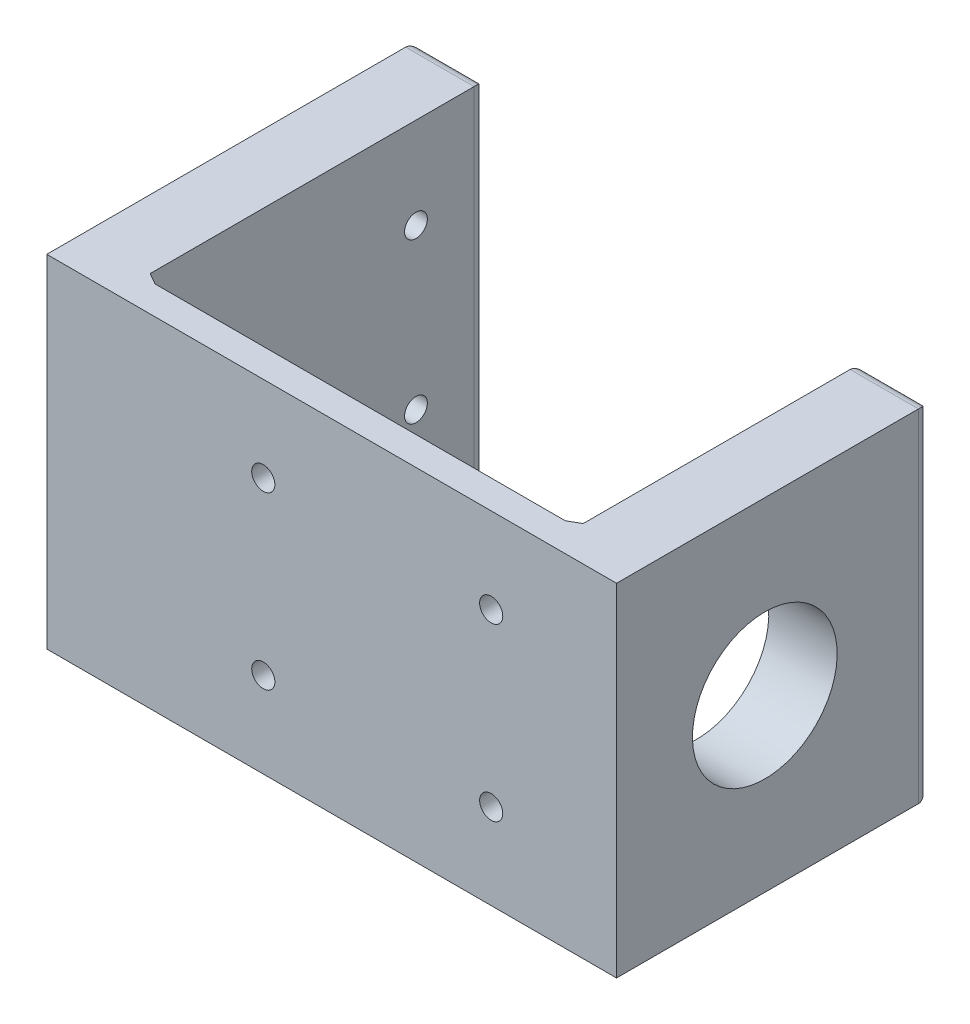
ISO-10303-21;
HEADER;
FILE_DESCRIPTION(('STEP AP214'),'2;1');
FILE_NAME('part.step','',(''),(''),'','','');
FILE_SCHEMA(('AUTOMOTIVE_DESIGN { 1 0 10303 214 1 1 1 1 }'));
ENDSEC;
DATA;
#1=APPLICATION_CONTEXT('core data for automotive mechanical design processes');
#2=APPLICATION_PROTOCOL_DEFINITION('international standard','automotive_design',2000,#1);
#3=PRODUCT_CONTEXT('',#1,'mechanical');
#4=PRODUCT('Part','Part','',(#3));
#5=PRODUCT_RELATED_PRODUCT_CATEGORY('part','',(#4));
#6=PRODUCT_DEFINITION_FORMATION('','',#4);
#7=PRODUCT_DEFINITION_CONTEXT('part definition',#1,'design');
#8=PRODUCT_DEFINITION('design','',#6,#7);
#9=PRODUCT_DEFINITION_SHAPE('','',#8);
#10=(LENGTH_UNIT() NAMED_UNIT(*) SI_UNIT(.MILLI.,.METRE.));
#11=(NAMED_UNIT(*) PLANE_ANGLE_UNIT() SI_UNIT($,.RADIAN.));
#12=(NAMED_UNIT(*) SI_UNIT($,.STERADIAN.) SOLID_ANGLE_UNIT());
#13=UNCERTAINTY_MEASURE_WITH_UNIT(LENGTH_MEASURE(1.E-05),#10,'distance_accuracy_value','');
#14=(GEOMETRIC_REPRESENTATION_CONTEXT(3) GLOBAL_UNCERTAINTY_ASSIGNED_CONTEXT((#13)) GLOBAL_UNIT_ASSIGNED_CONTEXT((#10,
#11,#12)) REPRESENTATION_CONTEXT('',''));
#15=CARTESIAN_POINT('',(0.,0.,0.));
#16=DIRECTION('',(0.,0.,1.));
#17=DIRECTION('',(1.,0.,0.));
#18=AXIS2_PLACEMENT_3D('',#15,#16,#17);
#19=CARTESIAN_POINT('',(0.,0.,0.));
#20=DIRECTION('',(0.,0.,-1.));
#21=DIRECTION('',(-1.,0.,0.));
#22=AXIS2_PLACEMENT_3D('',#19,#20,#21);
#23=PLANE('',#22);
#24=CARTESIAN_POINT('',(-78.74,57.15,0.));
#25=DIRECTION('',(0.,0.,1.));
#26=DIRECTION('',(1.,0.,0.));
#27=AXIS2_PLACEMENT_3D('',#24,#25,#26);
#28=CIRCLE('',#27,2.57975099999999);
#29=CARTESIAN_POINT('',(-76.160249,57.15,0.));
#30=VERTEX_POINT('',#29);
#31=EDGE_CURVE('E322',#30,#30,#28,.T.);
#32=ORIENTED_EDGE('',*,*,#31,.T.);
#33=EDGE_LOOP('',(#32));
#34=FACE_BOUND('',#33,.T.);
#35=CARTESIAN_POINT('',(-78.74,19.05,0.));
#36=DIRECTION('',(0.,0.,1.));
#37=DIRECTION('',(1.,0.,0.));
#38=AXIS2_PLACEMENT_3D('',#35,#36,#37);
#39=CIRCLE('',#38,2.57975099999999);
#40=CARTESIAN_POINT('',(-76.160249,19.05,0.));
#41=VERTEX_POINT('',#40);
#42=EDGE_CURVE('E330',#41,#41,#39,.T.);
#43=ORIENTED_EDGE('',*,*,#42,.T.);
#44=EDGE_LOOP('',(#43));
#45=FACE_BOUND('',#44,.T.);
#46=CARTESIAN_POINT('',(-27.94,57.15,0.));
#47=DIRECTION('',(0.,0.,1.));
#48=DIRECTION('',(1.,0.,0.));
#49=AXIS2_PLACEMENT_3D('',#46,#47,#48);
#50=CIRCLE('',#49,2.57975099999999);
#51=CARTESIAN_POINT('',(-25.360249,57.15,0.));
#52=VERTEX_POINT('',#51);
#53=EDGE_CURVE('E338',#52,#52,#50,.T.);
#54=ORIENTED_EDGE('',*,*,#53,.T.);
#55=EDGE_LOOP('',(#54));
#56=FACE_BOUND('',#55,.T.);
#57=CARTESIAN_POINT('',(-27.94,19.05,0.));
#58=DIRECTION('',(0.,0.,1.));
#59=DIRECTION('',(1.,0.,0.));
#60=AXIS2_PLACEMENT_3D('',#57,#58,#59);
#61=CIRCLE('',#60,2.57975099999999);
#62=CARTESIAN_POINT('',(-25.360249,19.05,0.));
#63=VERTEX_POINT('',#62);
#64=EDGE_CURVE('E186',#63,#63,#61,.T.);
#65=ORIENTED_EDGE('',*,*,#64,.T.);
#66=EDGE_LOOP('',(#65));
#67=FACE_BOUND('',#66,.T.);
#68=DIRECTION('',(1.,0.,0.));
#69=VECTOR('',#68,1.);
#70=CARTESIAN_POINT('',(-127.,0.,0.));
#71=LINE('',#70,#69);
#72=CARTESIAN_POINT('',(-109.22,0.,0.));
#73=VERTEX_POINT('',#72);
#74=CARTESIAN_POINT('',(-17.78,0.,0.));
#75=VERTEX_POINT('',#74);
#76=EDGE_CURVE('E183',#73,#75,#71,.T.);
#77=ORIENTED_EDGE('',*,*,#76,.F.);
#78=DIRECTION('',(0.,1.,0.));
#79=VECTOR('',#78,1.);
#80=CARTESIAN_POINT('',(-109.22,0.,0.));
#81=LINE('',#80,#79);
#82=CARTESIAN_POINT('',(-109.22,76.2,0.));
#83=VERTEX_POINT('',#82);
#84=EDGE_CURVE('E255',#73,#83,#81,.T.);
#85=ORIENTED_EDGE('',*,*,#84,.T.);
#86=DIRECTION('',(1.,0.,0.));
#87=VECTOR('',#86,1.);
#88=CARTESIAN_POINT('',(-127.,76.2,0.));
#89=LINE('',#88,#87);
#90=CARTESIAN_POINT('',(-17.78,76.2,0.));
#91=VERTEX_POINT('',#90);
#92=EDGE_CURVE('E157',#83,#91,#89,.T.);
#93=ORIENTED_EDGE('',*,*,#92,.T.);
#94=DIRECTION('',(0.,-1.,0.));
#95=VECTOR('',#94,1.);
#96=CARTESIAN_POINT('',(-17.78,0.,0.));
#97=LINE('',#96,#95);
#98=EDGE_CURVE('E199',#91,#75,#97,.T.);
#99=ORIENTED_EDGE('',*,*,#98,.T.);
#100=EDGE_LOOP('',(#77,#85,#93,#99));
#101=FACE_BOUND('',#100,.T.);
#102=ADVANCED_FACE('F41',(#34,#45,#56,#67,#101),#23,.T.);
#103=CARTESIAN_POINT('',(-127.,0.,6.35));
#104=DIRECTION('',(0.,1.,0.));
#105=DIRECTION('',(0.,0.,1.));
#106=AXIS2_PLACEMENT_3D('',#103,#104,#105);
#107=PLANE('',#106);
#108=DIRECTION('',(0.,0.,-1.));
#109=VECTOR('',#108,1.);
#110=CARTESIAN_POINT('',(-127.,0.,6.35));
#111=LINE('',#110,#109);
#112=CARTESIAN_POINT('',(-127.,0.,6.35));
#113=VERTEX_POINT('',#112);
#114=CARTESIAN_POINT('',(-127.,0.,-73.66));
#115=VERTEX_POINT('',#114);
#116=EDGE_CURVE('E182',#113,#115,#111,.T.);
#117=ORIENTED_EDGE('',*,*,#116,.T.);
#118=DIRECTION('',(-1.,0.,0.));
#119=VECTOR('',#118,1.);
#120=CARTESIAN_POINT('',(-111.76,0.,-73.66));
#121=LINE('',#120,#119);
#122=CARTESIAN_POINT('',(-111.76,0.,-73.66));
#123=VERTEX_POINT('',#122);
#124=EDGE_CURVE('E278',#115,#123,#121,.F.);
#125=ORIENTED_EDGE('',*,*,#124,.T.);
#126=DIRECTION('',(0.,0.,1.));
#127=VECTOR('',#126,1.);
#128=CARTESIAN_POINT('',(-111.76,0.,-76.2));
#129=LINE('',#128,#127);
#130=CARTESIAN_POINT('',(-111.76,0.,-1.46646968374167));
#131=VERTEX_POINT('',#130);
#132=EDGE_CURVE('E301',#123,#131,#129,.T.);
#133=ORIENTED_EDGE('',*,*,#132,.T.);
#134=DIRECTION('',(0.866025403784438,0.,0.500000000000001));
#135=VECTOR('',#134,1.);
#136=CARTESIAN_POINT('',(-119.805369342985,0.,-6.11146583964366));
#137=LINE('',#136,#135);
#138=EDGE_CURVE('E258',#131,#73,#137,.T.);
#139=ORIENTED_EDGE('',*,*,#138,.T.);
#140=ORIENTED_EDGE('',*,*,#76,.T.);
#141=DIRECTION('',(0.866025403784436,0.,-0.500000000000005));
#142=VECTOR('',#141,1.);
#143=CARTESIAN_POINT('',(-102.444630657015,0.,48.8811473006686));
#144=LINE('',#143,#142);
#145=CARTESIAN_POINT('',(-15.24,0.,-1.46646968374164));
#146=VERTEX_POINT('',#145);
#147=EDGE_CURVE('E207',#75,#146,#144,.T.);
#148=ORIENTED_EDGE('',*,*,#147,.T.);
#149=DIRECTION('',(0.,0.,1.));
#150=VECTOR('',#149,1.);
#151=CARTESIAN_POINT('',(-15.24,0.,-63.5));
#152=LINE('',#151,#150);
#153=CARTESIAN_POINT('',(-15.24,0.,-60.96));
#154=VERTEX_POINT('',#153);
#155=EDGE_CURVE('E251',#154,#146,#152,.T.);
#156=ORIENTED_EDGE('',*,*,#155,.F.);
#157=DIRECTION('',(-1.,0.,0.));
#158=VECTOR('',#157,1.);
#159=CARTESIAN_POINT('',(0.,0.,-60.96));
#160=LINE('',#159,#158);
#161=CARTESIAN_POINT('',(0.,0.,-60.96));
#162=VERTEX_POINT('',#161);
#163=EDGE_CURVE('E165',#154,#162,#160,.F.);
#164=ORIENTED_EDGE('',*,*,#163,.T.);
#165=DIRECTION('',(0.,0.,-1.));
#166=VECTOR('',#165,1.);
#167=CARTESIAN_POINT('',(0.,0.,6.35));
#168=LINE('',#167,#166);
#169=CARTESIAN_POINT('',(0.,0.,6.35));
#170=VERTEX_POINT('',#169);
#171=EDGE_CURVE('E161',#170,#162,#168,.T.);
#172=ORIENTED_EDGE('',*,*,#171,.F.);
#173=DIRECTION('',(1.,0.,0.));
#174=VECTOR('',#173,1.);
#175=CARTESIAN_POINT('',(-127.,0.,6.35));
#176=LINE('',#175,#174);
#177=EDGE_CURVE('E144',#113,#170,#176,.T.);
#178=ORIENTED_EDGE('',*,*,#177,.F.);
#179=EDGE_LOOP('',(#117,#125,#133,#139,#140,#148,#156,#164,#172,#178));
#180=FACE_BOUND('',#179,.T.);
#181=ADVANCED_FACE('F162',(#180),#107,.F.);
#182=CARTESIAN_POINT('',(0.,76.2,6.35));
#183=DIRECTION('',(1.,0.,0.));
#184=DIRECTION('',(0.,1.,0.));
#185=AXIS2_PLACEMENT_3D('',#182,#183,#184);
#186=PLANE('',#185);
#187=CARTESIAN_POINT('',(0.,38.019999999998,-26.700000000002));
#188=DIRECTION('',(1.,0.,0.));
#189=DIRECTION('',(0.,1.,0.));
#190=AXIS2_PLACEMENT_3D('',#187,#188,#189);
#191=CIRCLE('',#190,16.129);
#192=CARTESIAN_POINT('',(0.,54.148999999998,-26.700000000002));
#193=VERTEX_POINT('',#192);
#194=EDGE_CURVE('E667',#193,#193,#191,.T.);
#195=ORIENTED_EDGE('',*,*,#194,.F.);
#196=EDGE_LOOP('',(#195));
#197=FACE_BOUND('',#196,.T.);
#198=ORIENTED_EDGE('',*,*,#171,.T.);
#199=DIRECTION('',(0.,-1.,0.));
#200=VECTOR('',#199,1.);
#201=CARTESIAN_POINT('',(0.,76.2,-60.96));
#202=LINE('',#201,#200);
#203=CARTESIAN_POINT('',(0.,76.2,-60.96));
#204=VERTEX_POINT('',#203);
#205=EDGE_CURVE('E232',#162,#204,#202,.F.);
#206=ORIENTED_EDGE('',*,*,#205,.T.);
#207=DIRECTION('',(0.,0.,-1.));
#208=VECTOR('',#207,1.);
#209=CARTESIAN_POINT('',(0.,76.2,6.35));
#210=LINE('',#209,#208);
#211=CARTESIAN_POINT('',(0.,76.2,6.35));
#212=VERTEX_POINT('',#211);
#213=EDGE_CURVE('E169',#212,#204,#210,.T.);
#214=ORIENTED_EDGE('',*,*,#213,.F.);
#215=DIRECTION('',(0.,-1.,0.));
#216=VECTOR('',#215,1.);
#217=CARTESIAN_POINT('',(0.,76.2,6.35));
#218=LINE('',#217,#216);
#219=EDGE_CURVE('E149',#212,#170,#218,.T.);
#220=ORIENTED_EDGE('',*,*,#219,.T.);
#221=EDGE_LOOP('',(#198,#206,#214,#220));
#222=FACE_BOUND('',#221,.T.);
#223=ADVANCED_FACE('F171',(#197,#222),#186,.T.);
#224=CARTESIAN_POINT('',(-127.,76.2,6.35));
#225=DIRECTION('',(0.,1.,0.));
#226=DIRECTION('',(-1.,0.,0.));
#227=AXIS2_PLACEMENT_3D('',#224,#225,#226);
#228=PLANE('',#227);
#229=DIRECTION('',(0.,0.,1.));
#230=VECTOR('',#229,1.);
#231=CARTESIAN_POINT('',(-111.76,76.2,-76.2));
#232=LINE('',#231,#230);
#233=CARTESIAN_POINT('',(-111.76,76.2,-73.66));
#234=VERTEX_POINT('',#233);
#235=CARTESIAN_POINT('',(-111.76,76.2,-1.46646968374167));
#236=VERTEX_POINT('',#235);
#237=EDGE_CURVE('E240',#234,#236,#232,.T.);
#238=ORIENTED_EDGE('',*,*,#237,.F.);
#239=DIRECTION('',(1.,0.,0.));
#240=VECTOR('',#239,1.);
#241=CARTESIAN_POINT('',(-127.,76.2,-73.66));
#242=LINE('',#241,#240);
#243=CARTESIAN_POINT('',(-127.,76.2,-73.66));
#244=VERTEX_POINT('',#243);
#245=EDGE_CURVE('E11',#234,#244,#242,.F.);
#246=ORIENTED_EDGE('',*,*,#245,.T.);
#247=DIRECTION('',(0.,0.,-1.));
#248=VECTOR('',#247,1.);
#249=CARTESIAN_POINT('',(-127.,76.2,6.35));
#250=LINE('',#249,#248);
#251=CARTESIAN_POINT('',(-127.,76.2,6.35));
#252=VERTEX_POINT('',#251);
#253=EDGE_CURVE('E191',#252,#244,#250,.T.);
#254=ORIENTED_EDGE('',*,*,#253,.F.);
#255=DIRECTION('',(1.,0.,0.));
#256=VECTOR('',#255,1.);
#257=CARTESIAN_POINT('',(-127.,76.2,6.35));
#258=LINE('',#257,#256);
#259=EDGE_CURVE('E174',#252,#212,#258,.T.);
#260=ORIENTED_EDGE('',*,*,#259,.T.);
#261=ORIENTED_EDGE('',*,*,#213,.T.);
#262=DIRECTION('',(1.,0.,0.));
#263=VECTOR('',#262,1.);
#264=CARTESIAN_POINT('',(-127.,76.2,-60.96));
#265=LINE('',#264,#263);
#266=CARTESIAN_POINT('',(-15.24,76.2,-60.96));
#267=VERTEX_POINT('',#266);
#268=EDGE_CURVE('E229',#204,#267,#265,.F.);
#269=ORIENTED_EDGE('',*,*,#268,.T.);
#270=DIRECTION('',(0.,0.,1.));
#271=VECTOR('',#270,1.);
#272=CARTESIAN_POINT('',(-15.24,76.2,-63.5));
#273=LINE('',#272,#271);
#274=CARTESIAN_POINT('',(-15.24,76.2,-1.46646968374164));
#275=VERTEX_POINT('',#274);
#276=EDGE_CURVE('E315',#267,#275,#273,.T.);
#277=ORIENTED_EDGE('',*,*,#276,.T.);
#278=DIRECTION('',(-0.866025403784436,0.,0.500000000000005));
#279=VECTOR('',#278,1.);
#280=CARTESIAN_POINT('',(-15.24,76.2,-1.46646968374164));
#281=LINE('',#280,#279);
#282=EDGE_CURVE('E203',#275,#91,#281,.T.);
#283=ORIENTED_EDGE('',*,*,#282,.T.);
#284=ORIENTED_EDGE('',*,*,#92,.F.);
#285=DIRECTION('',(-0.866025403784438,0.,-0.500000000000001));
#286=VECTOR('',#285,1.);
#287=CARTESIAN_POINT('',(-111.76,76.2,-1.46646968374164));
#288=LINE('',#287,#286);
#289=EDGE_CURVE('E261',#83,#236,#288,.T.);
#290=ORIENTED_EDGE('',*,*,#289,.T.);
#291=EDGE_LOOP('',(#238,#246,#254,#260,#261,#269,#277,#283,#284,#290));
#292=FACE_BOUND('',#291,.T.);
#293=ADVANCED_FACE('F365',(#292),#228,.T.);
#294=CARTESIAN_POINT('',(-127.,76.2,6.35));
#295=DIRECTION('',(1.,0.,0.));
#296=DIRECTION('',(0.,1.,0.));
#297=AXIS2_PLACEMENT_3D('',#294,#295,#296);
#298=PLANE('',#297);
#299=CARTESIAN_POINT('',(-127.,55.88,-12.7));
#300=DIRECTION('',(-1.,0.,0.));
#301=DIRECTION('',(0.,1.,0.));
#302=AXIS2_PLACEMENT_3D('',#299,#300,#301);
#303=CIRCLE('',#302,2.54);
#304=CARTESIAN_POINT('',(-127.,58.42,-12.7));
#305=VERTEX_POINT('',#304);
#306=EDGE_CURVE('E689',#305,#305,#303,.T.);
#307=ORIENTED_EDGE('',*,*,#306,.F.);
#308=EDGE_LOOP('',(#307));
#309=FACE_BOUND('',#308,.T.);
#310=CARTESIAN_POINT('',(-127.,20.32,-60.7000000000003));
#311=DIRECTION('',(-1.,0.,0.));
#312=DIRECTION('',(0.,-1.,0.));
#313=AXIS2_PLACEMENT_3D('',#310,#311,#312);
#314=CIRCLE('',#313,2.54);
#315=CARTESIAN_POINT('',(-127.,17.78,-60.7000000000003));
#316=VERTEX_POINT('',#315);
#317=EDGE_CURVE('E684',#316,#316,#314,.T.);
#318=ORIENTED_EDGE('',*,*,#317,.F.);
#319=EDGE_LOOP('',(#318));
#320=FACE_BOUND('',#319,.T.);
#321=CARTESIAN_POINT('',(-127.,55.88,-60.7000000000003));
#322=DIRECTION('',(-1.,0.,0.));
#323=DIRECTION('',(0.,1.,0.));
#324=AXIS2_PLACEMENT_3D('',#321,#322,#323);
#325=CIRCLE('',#324,2.54);
#326=CARTESIAN_POINT('',(-127.,58.42,-60.7000000000003));
#327=VERTEX_POINT('',#326);
#328=EDGE_CURVE('E672',#327,#327,#325,.T.);
#329=ORIENTED_EDGE('',*,*,#328,.F.);
#330=EDGE_LOOP('',(#329));
#331=FACE_BOUND('',#330,.T.);
#332=CARTESIAN_POINT('',(-127.,20.32,-12.7));
#333=DIRECTION('',(-1.,0.,0.));
#334=DIRECTION('',(0.,-1.,0.));
#335=AXIS2_PLACEMENT_3D('',#332,#333,#334);
#336=CIRCLE('',#335,2.54);
#337=CARTESIAN_POINT('',(-127.,17.78,-12.7));
#338=VERTEX_POINT('',#337);
#339=EDGE_CURVE('E290',#338,#338,#336,.T.);
#340=ORIENTED_EDGE('',*,*,#339,.F.);
#341=EDGE_LOOP('',(#340));
#342=FACE_BOUND('',#341,.T.);
#343=ORIENTED_EDGE('',*,*,#253,.T.);
#344=DIRECTION('',(0.,1.,0.));
#345=VECTOR('',#344,1.);
#346=CARTESIAN_POINT('',(-127.,0.,-73.66));
#347=LINE('',#346,#345);
#348=EDGE_CURVE('E51',#244,#115,#347,.F.);
#349=ORIENTED_EDGE('',*,*,#348,.T.);
#350=ORIENTED_EDGE('',*,*,#116,.F.);
#351=DIRECTION('',(0.,-1.,0.));
#352=VECTOR('',#351,1.);
#353=CARTESIAN_POINT('',(-127.,76.2,6.35));
#354=LINE('',#353,#352);
#355=EDGE_CURVE('E152',#252,#113,#354,.T.);
#356=ORIENTED_EDGE('',*,*,#355,.F.);
#357=EDGE_LOOP('',(#343,#349,#350,#356));
#358=FACE_BOUND('',#357,.T.);
#359=ADVANCED_FACE('F359',(#309,#320,#331,#342,#358),#298,.F.);
#360=CARTESIAN_POINT('',(0.,0.,6.35));
#361=DIRECTION('',(0.,0.,-1.));
#362=DIRECTION('',(-1.,0.,0.));
#363=AXIS2_PLACEMENT_3D('',#360,#361,#362);
#364=PLANE('',#363);
#365=CARTESIAN_POINT('',(-78.74,57.15,6.35));
#366=DIRECTION('',(0.,0.,1.));
#367=DIRECTION('',(1.,0.,0.));
#368=AXIS2_PLACEMENT_3D('',#365,#366,#367);
#369=CIRCLE('',#368,2.57975100000001);
#370=CARTESIAN_POINT('',(-76.160249,57.15,6.35));
#371=VERTEX_POINT('',#370);
#372=EDGE_CURVE('E318',#371,#371,#369,.T.);
#373=ORIENTED_EDGE('',*,*,#372,.F.);
#374=EDGE_LOOP('',(#373));
#375=FACE_BOUND('',#374,.T.);
#376=CARTESIAN_POINT('',(-78.74,19.05,6.35));
#377=DIRECTION('',(0.,0.,1.));
#378=DIRECTION('',(1.,0.,0.));
#379=AXIS2_PLACEMENT_3D('',#376,#377,#378);
#380=CIRCLE('',#379,2.57975100000001);
#381=CARTESIAN_POINT('',(-76.160249,19.05,6.35));
#382=VERTEX_POINT('',#381);
#383=EDGE_CURVE('E326',#382,#382,#380,.T.);
#384=ORIENTED_EDGE('',*,*,#383,.F.);
#385=EDGE_LOOP('',(#384));
#386=FACE_BOUND('',#385,.T.);
#387=CARTESIAN_POINT('',(-27.94,57.15,6.35));
#388=DIRECTION('',(0.,0.,1.));
#389=DIRECTION('',(1.,0.,0.));
#390=AXIS2_PLACEMENT_3D('',#387,#388,#389);
#391=CIRCLE('',#390,2.579751);
#392=CARTESIAN_POINT('',(-25.360249,57.15,6.35));
#393=VERTEX_POINT('',#392);
#394=EDGE_CURVE('E334',#393,#393,#391,.T.);
#395=ORIENTED_EDGE('',*,*,#394,.F.);
#396=EDGE_LOOP('',(#395));
#397=FACE_BOUND('',#396,.T.);
#398=CARTESIAN_POINT('',(-27.94,19.05,6.35));
#399=DIRECTION('',(0.,0.,1.));
#400=DIRECTION('',(1.,0.,0.));
#401=AXIS2_PLACEMENT_3D('',#398,#399,#400);
#402=CIRCLE('',#401,2.579751);
#403=CARTESIAN_POINT('',(-25.360249,19.05,6.35));
#404=VERTEX_POINT('',#403);
#405=EDGE_CURVE('E342',#404,#404,#402,.T.);
#406=ORIENTED_EDGE('',*,*,#405,.F.);
#407=EDGE_LOOP('',(#406));
#408=FACE_BOUND('',#407,.T.);
#409=ORIENTED_EDGE('',*,*,#177,.T.);
#410=ORIENTED_EDGE('',*,*,#219,.F.);
#411=ORIENTED_EDGE('',*,*,#259,.F.);
#412=ORIENTED_EDGE('',*,*,#355,.T.);
#413=EDGE_LOOP('',(#409,#410,#411,#412));
#414=FACE_BOUND('',#413,.T.);
#415=ADVANCED_FACE('F146',(#375,#386,#397,#408,#414),#364,.F.);
#416=CARTESIAN_POINT('',(-27.94,19.05,6.35));
#417=DIRECTION('',(0.,0.,1.));
#418=DIRECTION('',(1.,0.,0.));
#419=AXIS2_PLACEMENT_3D('',#416,#417,#418);
#420=CYLINDRICAL_SURFACE('',#419,2.57975099999999);
#421=ORIENTED_EDGE('',*,*,#64,.F.);
#422=EDGE_LOOP('',(#421));
#423=FACE_BOUND('',#422,.T.);
#424=ORIENTED_EDGE('',*,*,#405,.T.);
#425=EDGE_LOOP('',(#424));
#426=FACE_BOUND('',#425,.T.);
#427=ADVANCED_FACE('F351',(#423,#426),#420,.F.);
#428=CARTESIAN_POINT('',(-27.94,57.15,6.35));
#429=DIRECTION('',(0.,0.,1.));
#430=DIRECTION('',(1.,0.,0.));
#431=AXIS2_PLACEMENT_3D('',#428,#429,#430);
#432=CYLINDRICAL_SURFACE('',#431,2.57975099999999);
#433=ORIENTED_EDGE('',*,*,#53,.F.);
#434=EDGE_LOOP('',(#433));
#435=FACE_BOUND('',#434,.T.);
#436=ORIENTED_EDGE('',*,*,#394,.T.);
#437=EDGE_LOOP('',(#436));
#438=FACE_BOUND('',#437,.T.);
#439=ADVANCED_FACE('F354',(#435,#438),#432,.F.);
#440=CARTESIAN_POINT('',(-78.74,19.05,6.35));
#441=DIRECTION('',(0.,0.,1.));
#442=DIRECTION('',(1.,0.,0.));
#443=AXIS2_PLACEMENT_3D('',#440,#441,#442);
#444=CYLINDRICAL_SURFACE('',#443,2.579751);
#445=ORIENTED_EDGE('',*,*,#42,.F.);
#446=EDGE_LOOP('',(#445));
#447=FACE_BOUND('',#446,.T.);
#448=ORIENTED_EDGE('',*,*,#383,.T.);
#449=EDGE_LOOP('',(#448));
#450=FACE_BOUND('',#449,.T.);
#451=ADVANCED_FACE('F453',(#447,#450),#444,.F.);
#452=CARTESIAN_POINT('',(-78.74,57.15,6.35));
#453=DIRECTION('',(0.,0.,1.));
#454=DIRECTION('',(1.,0.,0.));
#455=AXIS2_PLACEMENT_3D('',#452,#453,#454);
#456=CYLINDRICAL_SURFACE('',#455,2.579751);
#457=ORIENTED_EDGE('',*,*,#31,.F.);
#458=EDGE_LOOP('',(#457));
#459=FACE_BOUND('',#458,.T.);
#460=ORIENTED_EDGE('',*,*,#372,.T.);
#461=EDGE_LOOP('',(#460));
#462=FACE_BOUND('',#461,.T.);
#463=ADVANCED_FACE('F449',(#459,#462),#456,.F.);
#464=CARTESIAN_POINT('',(-15.24,76.2,-63.5));
#465=DIRECTION('',(1.,0.,0.));
#466=DIRECTION('',(0.,1.,0.));
#467=AXIS2_PLACEMENT_3D('',#464,#465,#466);
#468=PLANE('',#467);
#469=CARTESIAN_POINT('',(-15.24,38.019999999998,-26.700000000002));
#470=DIRECTION('',(1.,0.,0.));
#471=DIRECTION('',(0.,1.,0.));
#472=AXIS2_PLACEMENT_3D('',#469,#470,#471);
#473=CIRCLE('',#472,16.129);
#474=CARTESIAN_POINT('',(-15.24,54.148999999998,-26.700000000002));
#475=VERTEX_POINT('',#474);
#476=EDGE_CURVE('E670',#475,#475,#473,.F.);
#477=ORIENTED_EDGE('',*,*,#476,.F.);
#478=EDGE_LOOP('',(#477));
#479=FACE_BOUND('',#478,.T.);
#480=ORIENTED_EDGE('',*,*,#276,.F.);
#481=DIRECTION('',(0.,1.,0.));
#482=VECTOR('',#481,1.);
#483=CARTESIAN_POINT('',(-15.24,0.,-60.96));
#484=LINE('',#483,#482);
#485=EDGE_CURVE('E226',#267,#154,#484,.F.);
#486=ORIENTED_EDGE('',*,*,#485,.T.);
#487=ORIENTED_EDGE('',*,*,#155,.T.);
#488=DIRECTION('',(0.,1.,0.));
#489=VECTOR('',#488,1.);
#490=CARTESIAN_POINT('',(-15.24,76.2,-1.46646968374164));
#491=LINE('',#490,#489);
#492=EDGE_CURVE('E168',#146,#275,#491,.T.);
#493=ORIENTED_EDGE('',*,*,#492,.T.);
#494=EDGE_LOOP('',(#480,#486,#487,#493));
#495=FACE_BOUND('',#494,.T.);
#496=ADVANCED_FACE('F445',(#479,#495),#468,.F.);
#497=CARTESIAN_POINT('',(0.,0.,-63.5));
#498=DIRECTION('',(0.,0.,-1.));
#499=DIRECTION('',(-1.,0.,0.));
#500=AXIS2_PLACEMENT_3D('',#497,#498,#499);
#501=PLANE('',#500);
#502=DIRECTION('',(0.,-1.,0.));
#503=VECTOR('',#502,1.);
#504=CARTESIAN_POINT('',(-2.54,0.,-63.5));
#505=LINE('',#504,#503);
#506=CARTESIAN_POINT('',(-2.54,73.66,-63.5));
#507=VERTEX_POINT('',#506);
#508=CARTESIAN_POINT('',(-2.54,2.54,-63.5));
#509=VERTEX_POINT('',#508);
#510=EDGE_CURVE('E211',#507,#509,#505,.T.);
#511=ORIENTED_EDGE('',*,*,#510,.T.);
#512=DIRECTION('',(-1.,0.,0.));
#513=VECTOR('',#512,1.);
#514=CARTESIAN_POINT('',(-15.24,2.54,-63.5));
#515=LINE('',#514,#513);
#516=CARTESIAN_POINT('',(-12.7,2.54,-63.5));
#517=VERTEX_POINT('',#516);
#518=EDGE_CURVE('E220',#509,#517,#515,.T.);
#519=ORIENTED_EDGE('',*,*,#518,.T.);
#520=DIRECTION('',(0.,1.,0.));
#521=VECTOR('',#520,1.);
#522=CARTESIAN_POINT('',(-12.7,76.2,-63.5));
#523=LINE('',#522,#521);
#524=CARTESIAN_POINT('',(-12.7,73.66,-63.5));
#525=VERTEX_POINT('',#524);
#526=EDGE_CURVE('E217',#517,#525,#523,.T.);
#527=ORIENTED_EDGE('',*,*,#526,.T.);
#528=DIRECTION('',(1.,0.,0.));
#529=VECTOR('',#528,1.);
#530=CARTESIAN_POINT('',(0.,73.66,-63.5));
#531=LINE('',#530,#529);
#532=EDGE_CURVE('E214',#525,#507,#531,.T.);
#533=ORIENTED_EDGE('',*,*,#532,.T.);
#534=EDGE_LOOP('',(#511,#519,#527,#533));
#535=FACE_BOUND('',#534,.T.);
#536=ADVANCED_FACE('F388',(#535),#501,.T.);
#537=CARTESIAN_POINT('',(-15.24,76.2,-1.46646968374164));
#538=DIRECTION('',(0.500000000000005,0.,0.866025403784436));
#539=DIRECTION('',(0.,1.,0.));
#540=AXIS2_PLACEMENT_3D('',#537,#538,#539);
#541=PLANE('',#540);
#542=ORIENTED_EDGE('',*,*,#147,.F.);
#543=ORIENTED_EDGE('',*,*,#98,.F.);
#544=ORIENTED_EDGE('',*,*,#282,.F.);
#545=ORIENTED_EDGE('',*,*,#492,.F.);
#546=EDGE_LOOP('',(#542,#543,#544,#545));
#547=FACE_BOUND('',#546,.T.);
#548=ADVANCED_FACE('F384',(#547),#541,.F.);
#549=CARTESIAN_POINT('',(0.,73.66,-60.96));
#550=DIRECTION('',(1.,0.,0.));
#551=DIRECTION('',(0.,1.,0.));
#552=AXIS2_PLACEMENT_3D('',#549,#550,#551);
#553=CYLINDRICAL_SURFACE('',#552,2.54);
#554=CARTESIAN_POINT('',(-12.7,73.66,-60.96));
#555=DIRECTION('',(0.707106781186547,0.707106781186547,0.));
#556=DIRECTION('',(0.707106781186547,-0.707106781186547,0.));
#557=AXIS2_PLACEMENT_3D('',#554,#555,#556);
#558=ELLIPSE('',#557,3.59210244842766,2.54);
#559=EDGE_CURVE('E243',#267,#525,#558,.F.);
#560=ORIENTED_EDGE('',*,*,#559,.F.);
#561=ORIENTED_EDGE('',*,*,#268,.F.);
#562=CARTESIAN_POINT('',(-2.54,73.66,-60.96));
#563=DIRECTION('',(0.707106781186548,-0.707106781186547,0.));
#564=DIRECTION('',(-0.707106781186547,-0.707106781186547,0.));
#565=AXIS2_PLACEMENT_3D('',#562,#563,#564);
#566=ELLIPSE('',#565,3.59210244842766,2.54);
#567=EDGE_CURVE('E247',#507,#204,#566,.T.);
#568=ORIENTED_EDGE('',*,*,#567,.F.);
#569=ORIENTED_EDGE('',*,*,#532,.F.);
#570=EDGE_LOOP('',(#560,#561,#568,#569));
#571=FACE_BOUND('',#570,.T.);
#572=ADVANCED_FACE('F387',(#571),#553,.T.);
#573=CARTESIAN_POINT('',(-2.54,0.,-60.96));
#574=DIRECTION('',(0.,-1.,0.));
#575=DIRECTION('',(1.,0.,0.));
#576=AXIS2_PLACEMENT_3D('',#573,#574,#575);
#577=CYLINDRICAL_SURFACE('',#576,2.54);
#578=ORIENTED_EDGE('',*,*,#567,.T.);
#579=ORIENTED_EDGE('',*,*,#205,.F.);
#580=CARTESIAN_POINT('',(-2.54,2.54,-60.96));
#581=DIRECTION('',(-0.707106781186547,-0.707106781186547,0.));
#582=DIRECTION('',(0.707106781186547,-0.707106781186547,0.));
#583=AXIS2_PLACEMENT_3D('',#580,#581,#582);
#584=ELLIPSE('',#583,3.59210244842766,2.54);
#585=EDGE_CURVE('E239',#509,#162,#584,.T.);
#586=ORIENTED_EDGE('',*,*,#585,.F.);
#587=ORIENTED_EDGE('',*,*,#510,.F.);
#588=EDGE_LOOP('',(#578,#579,#586,#587));
#589=FACE_BOUND('',#588,.T.);
#590=ADVANCED_FACE('F398',(#589),#577,.T.);
#591=CARTESIAN_POINT('',(-12.7,0.,-60.96));
#592=DIRECTION('',(0.,-1.,0.));
#593=DIRECTION('',(1.,0.,0.));
#594=AXIS2_PLACEMENT_3D('',#591,#592,#593);
#595=CYLINDRICAL_SURFACE('',#594,2.54);
#596=ORIENTED_EDGE('',*,*,#559,.T.);
#597=ORIENTED_EDGE('',*,*,#526,.F.);
#598=CARTESIAN_POINT('',(-12.7,2.54,-60.96));
#599=DIRECTION('',(0.707106781186547,-0.707106781186548,0.));
#600=DIRECTION('',(-0.707106781186547,-0.707106781186547,0.));
#601=AXIS2_PLACEMENT_3D('',#598,#599,#600);
#602=ELLIPSE('',#601,3.59210244842766,2.54);
#603=EDGE_CURVE('E236',#154,#517,#602,.T.);
#604=ORIENTED_EDGE('',*,*,#603,.F.);
#605=ORIENTED_EDGE('',*,*,#485,.F.);
#606=EDGE_LOOP('',(#596,#597,#604,#605));
#607=FACE_BOUND('',#606,.T.);
#608=ADVANCED_FACE('F394',(#607),#595,.T.);
#609=CARTESIAN_POINT('',(0.,2.54,-60.96));
#610=DIRECTION('',(1.,0.,0.));
#611=DIRECTION('',(0.,0.,-1.));
#612=AXIS2_PLACEMENT_3D('',#609,#610,#611);
#613=CYLINDRICAL_SURFACE('',#612,2.54);
#614=ORIENTED_EDGE('',*,*,#585,.T.);
#615=ORIENTED_EDGE('',*,*,#163,.F.);
#616=ORIENTED_EDGE('',*,*,#603,.T.);
#617=ORIENTED_EDGE('',*,*,#518,.F.);
#618=EDGE_LOOP('',(#614,#615,#616,#617));
#619=FACE_BOUND('',#618,.T.);
#620=ADVANCED_FACE('F390',(#619),#613,.T.);
#621=CARTESIAN_POINT('',(-111.76,76.2,-76.2));
#622=DIRECTION('',(-1.,0.,0.));
#623=DIRECTION('',(0.,0.,1.));
#624=AXIS2_PLACEMENT_3D('',#621,#622,#623);
#625=PLANE('',#624);
#626=CARTESIAN_POINT('',(-111.76,55.88,-12.7));
#627=DIRECTION('',(-1.,0.,0.));
#628=DIRECTION('',(0.,0.,1.));
#629=AXIS2_PLACEMENT_3D('',#626,#627,#628);
#630=CIRCLE('',#629,2.54);
#631=CARTESIAN_POINT('',(-111.76,55.88,-10.16));
#632=VERTEX_POINT('',#631);
#633=EDGE_CURVE('E685',#632,#632,#630,.F.);
#634=ORIENTED_EDGE('',*,*,#633,.F.);
#635=EDGE_LOOP('',(#634));
#636=FACE_BOUND('',#635,.T.);
#637=CARTESIAN_POINT('',(-111.76,20.32,-60.7000000000003));
#638=DIRECTION('',(-1.,0.,0.));
#639=DIRECTION('',(0.,0.,1.));
#640=AXIS2_PLACEMENT_3D('',#637,#638,#639);
#641=CIRCLE('',#640,2.54);
#642=CARTESIAN_POINT('',(-111.76,20.32,-58.1600000000003));
#643=VERTEX_POINT('',#642);
#644=EDGE_CURVE('E690',#643,#643,#641,.F.);
#645=ORIENTED_EDGE('',*,*,#644,.F.);
#646=EDGE_LOOP('',(#645));
#647=FACE_BOUND('',#646,.T.);
#648=CARTESIAN_POINT('',(-111.76,55.88,-60.7000000000003));
#649=DIRECTION('',(-1.,0.,0.));
#650=DIRECTION('',(0.,0.,1.));
#651=AXIS2_PLACEMENT_3D('',#648,#649,#650);
#652=CIRCLE('',#651,2.54);
#653=CARTESIAN_POINT('',(-111.76,55.88,-58.1600000000003));
#654=VERTEX_POINT('',#653);
#655=EDGE_CURVE('E677',#654,#654,#652,.F.);
#656=ORIENTED_EDGE('',*,*,#655,.F.);
#657=EDGE_LOOP('',(#656));
#658=FACE_BOUND('',#657,.T.);
#659=CARTESIAN_POINT('',(-111.76,20.32,-12.7));
#660=DIRECTION('',(-1.,0.,0.));
#661=DIRECTION('',(0.,0.,1.));
#662=AXIS2_PLACEMENT_3D('',#659,#660,#661);
#663=CIRCLE('',#662,2.54);
#664=CARTESIAN_POINT('',(-111.76,20.32,-10.16));
#665=VERTEX_POINT('',#664);
#666=EDGE_CURVE('E694',#665,#665,#663,.F.);
#667=ORIENTED_EDGE('',*,*,#666,.F.);
#668=EDGE_LOOP('',(#667));
#669=FACE_BOUND('',#668,.T.);
#670=ORIENTED_EDGE('',*,*,#132,.F.);
#671=DIRECTION('',(0.,-1.,0.));
#672=VECTOR('',#671,1.);
#673=CARTESIAN_POINT('',(-111.76,76.2,-73.66));
#674=LINE('',#673,#672);
#675=EDGE_CURVE('E65',#123,#234,#674,.F.);
#676=ORIENTED_EDGE('',*,*,#675,.T.);
#677=ORIENTED_EDGE('',*,*,#237,.T.);
#678=DIRECTION('',(0.,-1.,0.));
#679=VECTOR('',#678,1.);
#680=CARTESIAN_POINT('',(-111.76,76.2,-1.46646968374164));
#681=LINE('',#680,#679);
#682=EDGE_CURVE('E235',#236,#131,#681,.T.);
#683=ORIENTED_EDGE('',*,*,#682,.T.);
#684=EDGE_LOOP('',(#670,#676,#677,#683));
#685=FACE_BOUND('',#684,.T.);
#686=ADVANCED_FACE('F393',(#636,#647,#658,#669,#685),#625,.F.);
#687=CARTESIAN_POINT('',(0.,0.,-76.2));
#688=DIRECTION('',(0.,0.,-1.));
#689=DIRECTION('',(-1.,0.,0.));
#690=AXIS2_PLACEMENT_3D('',#687,#688,#689);
#691=PLANE('',#690);
#692=DIRECTION('',(0.,-1.,0.));
#693=VECTOR('',#692,1.);
#694=CARTESIAN_POINT('',(-114.3,0.,-76.2));
#695=LINE('',#694,#693);
#696=CARTESIAN_POINT('',(-114.3,73.66,-76.2));
#697=VERTEX_POINT('',#696);
#698=CARTESIAN_POINT('',(-114.3,2.54,-76.2));
#699=VERTEX_POINT('',#698);
#700=EDGE_CURVE('E271',#697,#699,#695,.T.);
#701=ORIENTED_EDGE('',*,*,#700,.T.);
#702=DIRECTION('',(-1.,0.,0.));
#703=VECTOR('',#702,1.);
#704=CARTESIAN_POINT('',(-127.,2.54,-76.2));
#705=LINE('',#704,#703);
#706=CARTESIAN_POINT('',(-124.46,2.54,-76.2));
#707=VERTEX_POINT('',#706);
#708=EDGE_CURVE('E274',#699,#707,#705,.T.);
#709=ORIENTED_EDGE('',*,*,#708,.T.);
#710=DIRECTION('',(0.,1.,0.));
#711=VECTOR('',#710,1.);
#712=CARTESIAN_POINT('',(-124.46,76.2,-76.2));
#713=LINE('',#712,#711);
#714=CARTESIAN_POINT('',(-124.46,73.66,-76.2));
#715=VERTEX_POINT('',#714);
#716=EDGE_CURVE('E268',#707,#715,#713,.T.);
#717=ORIENTED_EDGE('',*,*,#716,.T.);
#718=DIRECTION('',(1.,0.,0.));
#719=VECTOR('',#718,1.);
#720=CARTESIAN_POINT('',(0.,73.66,-76.2));
#721=LINE('',#720,#719);
#722=EDGE_CURVE('E265',#715,#697,#721,.T.);
#723=ORIENTED_EDGE('',*,*,#722,.T.);
#724=EDGE_LOOP('',(#701,#709,#717,#723));
#725=FACE_BOUND('',#724,.T.);
#726=ADVANCED_FACE('F409',(#725),#691,.T.);
#727=CARTESIAN_POINT('',(-111.76,76.2,-1.46646968374164));
#728=DIRECTION('',(-0.500000000000001,0.,0.866025403784438));
#729=DIRECTION('',(0.,-1.,0.));
#730=AXIS2_PLACEMENT_3D('',#727,#728,#729);
#731=PLANE('',#730);
#732=ORIENTED_EDGE('',*,*,#289,.F.);
#733=ORIENTED_EDGE('',*,*,#84,.F.);
#734=ORIENTED_EDGE('',*,*,#138,.F.);
#735=ORIENTED_EDGE('',*,*,#682,.F.);
#736=EDGE_LOOP('',(#732,#733,#734,#735));
#737=FACE_BOUND('',#736,.T.);
#738=ADVANCED_FACE('F406',(#737),#731,.F.);
#739=CARTESIAN_POINT('',(0.,73.66,-73.66));
#740=DIRECTION('',(1.,0.,0.));
#741=DIRECTION('',(0.,1.,0.));
#742=AXIS2_PLACEMENT_3D('',#739,#740,#741);
#743=CYLINDRICAL_SURFACE('',#742,2.54);
#744=CARTESIAN_POINT('',(-124.46,73.66,-73.66));
#745=DIRECTION('',(0.707106781186548,0.707106781186547,0.));
#746=DIRECTION('',(0.707106781186547,-0.707106781186548,0.));
#747=AXIS2_PLACEMENT_3D('',#744,#745,#746);
#748=ELLIPSE('',#747,3.59210244842766,2.54);
#749=EDGE_CURVE('E292',#244,#715,#748,.F.);
#750=ORIENTED_EDGE('',*,*,#749,.F.);
#751=ORIENTED_EDGE('',*,*,#245,.F.);
#752=CARTESIAN_POINT('',(-114.3,73.66,-73.66));
#753=DIRECTION('',(0.707106781186548,-0.707106781186547,0.));
#754=DIRECTION('',(0.707106781186547,0.707106781186547,0.));
#755=AXIS2_PLACEMENT_3D('',#752,#753,#754);
#756=ELLIPSE('',#755,3.59210244842766,2.54);
#757=EDGE_CURVE('E45',#697,#234,#756,.T.);
#758=ORIENTED_EDGE('',*,*,#757,.F.);
#759=ORIENTED_EDGE('',*,*,#722,.F.);
#760=EDGE_LOOP('',(#750,#751,#758,#759));
#761=FACE_BOUND('',#760,.T.);
#762=ADVANCED_FACE('F43',(#761),#743,.T.);
#763=CARTESIAN_POINT('',(-114.3,0.,-73.66));
#764=DIRECTION('',(0.,1.,0.));
#765=DIRECTION('',(0.,0.,1.));
#766=AXIS2_PLACEMENT_3D('',#763,#764,#765);
#767=CYLINDRICAL_SURFACE('',#766,2.54);
#768=ORIENTED_EDGE('',*,*,#757,.T.);
#769=ORIENTED_EDGE('',*,*,#675,.F.);
#770=CARTESIAN_POINT('',(-114.3,2.54,-73.66));
#771=DIRECTION('',(0.707106781186547,0.707106781186547,0.));
#772=DIRECTION('',(-0.707106781186547,0.707106781186547,0.));
#773=AXIS2_PLACEMENT_3D('',#770,#771,#772);
#774=ELLIPSE('',#773,3.59210244842766,2.54);
#775=EDGE_CURVE('E289',#699,#123,#774,.F.);
#776=ORIENTED_EDGE('',*,*,#775,.F.);
#777=ORIENTED_EDGE('',*,*,#700,.F.);
#778=EDGE_LOOP('',(#768,#769,#776,#777));
#779=FACE_BOUND('',#778,.T.);
#780=ADVANCED_FACE('F418',(#779),#767,.T.);
#781=CARTESIAN_POINT('',(-124.46,1.81336427355442E-13,-73.66));
#782=DIRECTION('',(0.,-1.,0.));
#783=DIRECTION('',(1.,0.,0.));
#784=AXIS2_PLACEMENT_3D('',#781,#782,#783);
#785=CYLINDRICAL_SURFACE('',#784,2.54);
#786=ORIENTED_EDGE('',*,*,#749,.T.);
#787=ORIENTED_EDGE('',*,*,#716,.F.);
#788=CARTESIAN_POINT('',(-124.46,2.54,-73.66));
#789=DIRECTION('',(0.707106781186547,-0.707106781186548,0.));
#790=DIRECTION('',(-0.707106781186548,-0.707106781186547,0.));
#791=AXIS2_PLACEMENT_3D('',#788,#789,#790);
#792=ELLIPSE('',#791,3.59210244842766,2.54);
#793=EDGE_CURVE('E286',#115,#707,#792,.T.);
#794=ORIENTED_EDGE('',*,*,#793,.F.);
#795=ORIENTED_EDGE('',*,*,#348,.F.);
#796=EDGE_LOOP('',(#786,#787,#794,#795));
#797=FACE_BOUND('',#796,.T.);
#798=ADVANCED_FACE('F415',(#797),#785,.T.);
#799=CARTESIAN_POINT('',(0.,2.54,-73.66));
#800=DIRECTION('',(1.,0.,0.));
#801=DIRECTION('',(0.,0.,-1.));
#802=AXIS2_PLACEMENT_3D('',#799,#800,#801);
#803=CYLINDRICAL_SURFACE('',#802,2.54);
#804=ORIENTED_EDGE('',*,*,#775,.T.);
#805=ORIENTED_EDGE('',*,*,#124,.F.);
#806=ORIENTED_EDGE('',*,*,#793,.T.);
#807=ORIENTED_EDGE('',*,*,#708,.F.);
#808=EDGE_LOOP('',(#804,#805,#806,#807));
#809=FACE_BOUND('',#808,.T.);
#810=ADVANCED_FACE('F411',(#809),#803,.T.);
#811=CARTESIAN_POINT('',(0.001000000000001,20.32,-12.7));
#812=DIRECTION('',(-1.,0.,0.));
#813=DIRECTION('',(0.,-1.,0.));
#814=AXIS2_PLACEMENT_3D('',#811,#812,#813);
#815=CYLINDRICAL_SURFACE('',#814,2.54);
#816=ORIENTED_EDGE('',*,*,#339,.T.);
#817=EDGE_LOOP('',(#816));
#818=FACE_BOUND('',#817,.T.);
#819=ORIENTED_EDGE('',*,*,#666,.T.);
#820=EDGE_LOOP('',(#819));
#821=FACE_BOUND('',#820,.T.);
#822=ADVANCED_FACE('F414',(#818,#821),#815,.F.);
#823=CARTESIAN_POINT('',(0.001000000000001,55.88,-60.7000000000003));
#824=DIRECTION('',(-1.,0.,0.));
#825=DIRECTION('',(0.,-1.,0.));
#826=AXIS2_PLACEMENT_3D('',#823,#824,#825);
#827=CYLINDRICAL_SURFACE('',#826,2.54);
#828=ORIENTED_EDGE('',*,*,#328,.T.);
#829=EDGE_LOOP('',(#828));
#830=FACE_BOUND('',#829,.T.);
#831=ORIENTED_EDGE('',*,*,#655,.T.);
#832=EDGE_LOOP('',(#831));
#833=FACE_BOUND('',#832,.T.);
#834=ADVANCED_FACE('F525',(#830,#833),#827,.F.);
#835=CARTESIAN_POINT('',(0.001000000000001,20.32,-60.7000000000003));
#836=DIRECTION('',(-1.,0.,0.));
#837=DIRECTION('',(0.,-1.,0.));
#838=AXIS2_PLACEMENT_3D('',#835,#836,#837);
#839=CYLINDRICAL_SURFACE('',#838,2.54);
#840=ORIENTED_EDGE('',*,*,#317,.T.);
#841=EDGE_LOOP('',(#840));
#842=FACE_BOUND('',#841,.T.);
#843=ORIENTED_EDGE('',*,*,#644,.T.);
#844=EDGE_LOOP('',(#843));
#845=FACE_BOUND('',#844,.T.);
#846=ADVANCED_FACE('F535',(#842,#845),#839,.F.);
#847=CARTESIAN_POINT('',(0.001000000000001,55.88,-12.7));
#848=DIRECTION('',(-1.,0.,0.));
#849=DIRECTION('',(0.,-1.,0.));
#850=AXIS2_PLACEMENT_3D('',#847,#848,#849);
#851=CYLINDRICAL_SURFACE('',#850,2.54);
#852=ORIENTED_EDGE('',*,*,#306,.T.);
#853=EDGE_LOOP('',(#852));
#854=FACE_BOUND('',#853,.T.);
#855=ORIENTED_EDGE('',*,*,#633,.T.);
#856=EDGE_LOOP('',(#855));
#857=FACE_BOUND('',#856,.T.);
#858=ADVANCED_FACE('F545',(#854,#857),#851,.F.);
#859=CARTESIAN_POINT('',(-127.001,38.019999999998,-26.700000000002));
#860=DIRECTION('',(1.,0.,0.));
#861=DIRECTION('',(0.,1.,0.));
#862=AXIS2_PLACEMENT_3D('',#859,#860,#861);
#863=CYLINDRICAL_SURFACE('',#862,16.129);
#864=ORIENTED_EDGE('',*,*,#194,.T.);
#865=EDGE_LOOP('',(#864));
#866=FACE_BOUND('',#865,.T.);
#867=ORIENTED_EDGE('',*,*,#476,.T.);
#868=EDGE_LOOP('',(#867));
#869=FACE_BOUND('',#868,.T.);
#870=ADVANCED_FACE('F553',(#866,#869),#863,.F.);
#871=CLOSED_SHELL('',(#102,#181,#223,#293,#359,#415,#427,#439,#451,#463,#496,#536,#548,#572,
#590,#608,#620,#686,#726,#738,#762,#780,#798,#810,#822,#834,#846,#858,#870));
#872=MANIFOLD_SOLID_BREP('B2',#871);
#873=ADVANCED_BREP_SHAPE_REPRESENTATION('',(#18,#872),#14);
#874=SHAPE_DEFINITION_REPRESENTATION(#9,#873);
ENDSEC;
END-ISO-10303-21;
